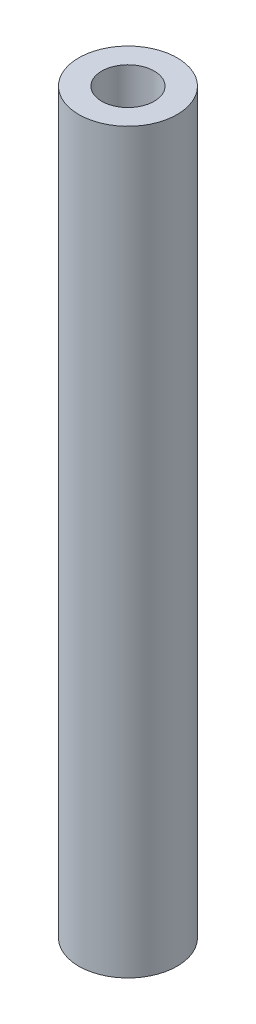
ISO-10303-21;
HEADER;
FILE_DESCRIPTION(('STEP AP214'),'2;1');
FILE_NAME('part.step','',(''),(''),'','','');
FILE_SCHEMA(('AUTOMOTIVE_DESIGN { 1 0 10303 214 1 1 1 1 }'));
ENDSEC;
DATA;
#1=APPLICATION_CONTEXT('core data for automotive mechanical design processes');
#2=APPLICATION_PROTOCOL_DEFINITION('international standard','automotive_design',2000,#1);
#3=PRODUCT_CONTEXT('',#1,'mechanical');
#4=PRODUCT('Part','Part','',(#3));
#5=PRODUCT_RELATED_PRODUCT_CATEGORY('part','',(#4));
#6=PRODUCT_DEFINITION_FORMATION('','',#4);
#7=PRODUCT_DEFINITION_CONTEXT('part definition',#1,'design');
#8=PRODUCT_DEFINITION('design','',#6,#7);
#9=PRODUCT_DEFINITION_SHAPE('','',#8);
#10=(LENGTH_UNIT() NAMED_UNIT(*) SI_UNIT(.MILLI.,.METRE.));
#11=(NAMED_UNIT(*) PLANE_ANGLE_UNIT() SI_UNIT($,.RADIAN.));
#12=(NAMED_UNIT(*) SI_UNIT($,.STERADIAN.) SOLID_ANGLE_UNIT());
#13=UNCERTAINTY_MEASURE_WITH_UNIT(LENGTH_MEASURE(1.E-05),#10,'distance_accuracy_value','');
#14=(GEOMETRIC_REPRESENTATION_CONTEXT(3) GLOBAL_UNCERTAINTY_ASSIGNED_CONTEXT((#13)) GLOBAL_UNIT_ASSIGNED_CONTEXT((#10,
#11,#12)) REPRESENTATION_CONTEXT('',''));
#15=CARTESIAN_POINT('',(0.,0.,0.));
#16=DIRECTION('',(0.,0.,1.));
#17=DIRECTION('',(1.,0.,0.));
#18=AXIS2_PLACEMENT_3D('',#15,#16,#17);
#19=CARTESIAN_POINT('',(0.,45.,0.));
#20=DIRECTION('',(0.,1.,0.));
#21=DIRECTION('',(0.,0.,1.));
#22=AXIS2_PLACEMENT_3D('',#19,#20,#21);
#23=PLANE('',#22);
#24=CARTESIAN_POINT('',(0.,45.,0.));
#25=DIRECTION('',(0.,1.,0.));
#26=DIRECTION('',(0.,0.,1.));
#27=AXIS2_PLACEMENT_3D('',#24,#25,#26);
#28=CIRCLE('',#27,3.);
#29=CARTESIAN_POINT('',(0.,45.,3.));
#30=VERTEX_POINT('',#29);
#31=EDGE_CURVE('E10',#30,#30,#28,.T.);
#32=ORIENTED_EDGE('',*,*,#31,.T.);
#33=EDGE_LOOP('',(#32));
#34=FACE_BOUND('',#33,.T.);
#35=CARTESIAN_POINT('',(0.,45.,0.));
#36=DIRECTION('',(0.,1.,0.));
#37=DIRECTION('',(0.,0.,1.));
#38=AXIS2_PLACEMENT_3D('',#35,#36,#37);
#39=CIRCLE('',#38,1.6);
#40=CARTESIAN_POINT('',(0.,45.,1.6));
#41=VERTEX_POINT('',#40);
#42=EDGE_CURVE('E43',#41,#41,#39,.T.);
#43=ORIENTED_EDGE('',*,*,#42,.F.);
#44=EDGE_LOOP('',(#43));
#45=FACE_BOUND('',#44,.T.);
#46=ADVANCED_FACE('F32',(#34,#45),#23,.T.);
#47=CARTESIAN_POINT('',(0.,0.,0.));
#48=DIRECTION('',(0.,1.,0.));
#49=DIRECTION('',(0.,0.,1.));
#50=AXIS2_PLACEMENT_3D('',#47,#48,#49);
#51=PLANE('',#50);
#52=CARTESIAN_POINT('',(0.,0.,0.));
#53=DIRECTION('',(0.,1.,0.));
#54=DIRECTION('',(0.,0.,1.));
#55=AXIS2_PLACEMENT_3D('',#52,#53,#54);
#56=CIRCLE('',#55,3.);
#57=CARTESIAN_POINT('',(0.,0.,3.));
#58=VERTEX_POINT('',#57);
#59=EDGE_CURVE('E36',#58,#58,#56,.T.);
#60=ORIENTED_EDGE('',*,*,#59,.F.);
#61=EDGE_LOOP('',(#60));
#62=FACE_BOUND('',#61,.T.);
#63=CARTESIAN_POINT('',(0.,0.,0.));
#64=DIRECTION('',(0.,1.,0.));
#65=DIRECTION('',(0.,0.,1.));
#66=AXIS2_PLACEMENT_3D('',#63,#64,#65);
#67=CIRCLE('',#66,1.6);
#68=CARTESIAN_POINT('',(0.,0.,1.6));
#69=VERTEX_POINT('',#68);
#70=EDGE_CURVE('E45',#69,#69,#67,.T.);
#71=ORIENTED_EDGE('',*,*,#70,.T.);
#72=EDGE_LOOP('',(#71));
#73=FACE_BOUND('',#72,.T.);
#74=ADVANCED_FACE('F55',(#62,#73),#51,.F.);
#75=CARTESIAN_POINT('',(0.,45.,0.));
#76=DIRECTION('',(0.,-1.,0.));
#77=DIRECTION('',(0.,0.,-1.));
#78=AXIS2_PLACEMENT_3D('',#75,#76,#77);
#79=CYLINDRICAL_SURFACE('',#78,3.);
#80=ORIENTED_EDGE('',*,*,#31,.F.);
#81=EDGE_LOOP('',(#80));
#82=FACE_BOUND('',#81,.T.);
#83=ORIENTED_EDGE('',*,*,#59,.T.);
#84=EDGE_LOOP('',(#83));
#85=FACE_BOUND('',#84,.T.);
#86=ADVANCED_FACE('F34',(#82,#85),#79,.T.);
#87=CARTESIAN_POINT('',(0.,45.,0.));
#88=DIRECTION('',(0.,-1.,0.));
#89=DIRECTION('',(0.,0.,-1.));
#90=AXIS2_PLACEMENT_3D('',#87,#88,#89);
#91=CYLINDRICAL_SURFACE('',#90,1.6);
#92=ORIENTED_EDGE('',*,*,#42,.T.);
#93=EDGE_LOOP('',(#92));
#94=FACE_BOUND('',#93,.T.);
#95=ORIENTED_EDGE('',*,*,#70,.F.);
#96=EDGE_LOOP('',(#95));
#97=FACE_BOUND('',#96,.T.);
#98=ADVANCED_FACE('F51',(#94,#97),#91,.F.);
#99=CLOSED_SHELL('',(#46,#74,#86,#98));
#100=MANIFOLD_SOLID_BREP('B2',#99);
#101=ADVANCED_BREP_SHAPE_REPRESENTATION('',(#18,#100),#14);
#102=SHAPE_DEFINITION_REPRESENTATION(#9,#101);
ENDSEC;
END-ISO-10303-21;
